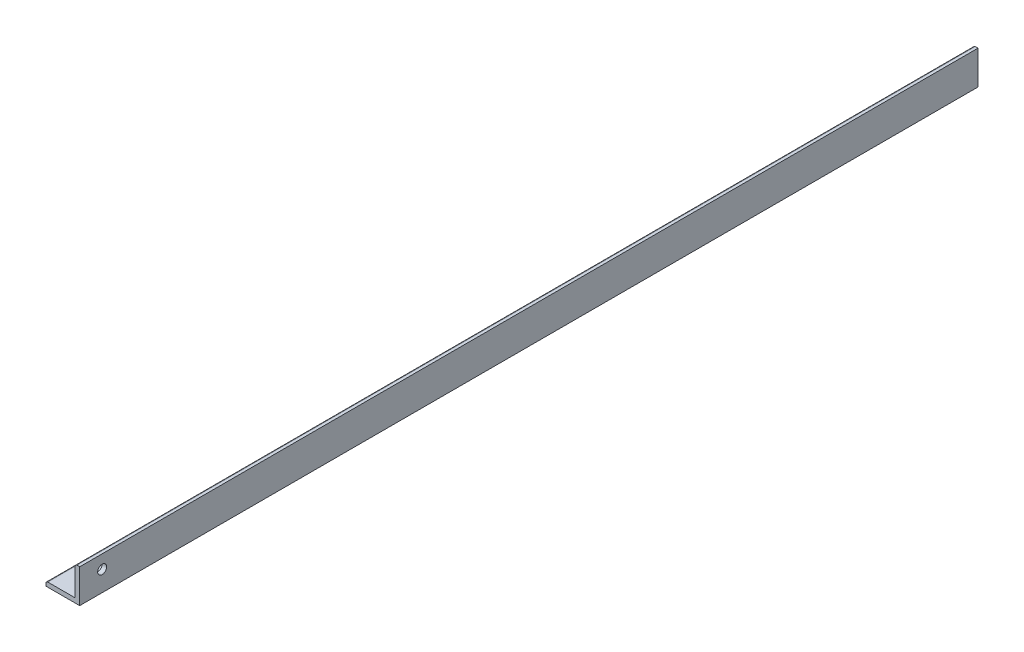
ISO-10303-21;
HEADER;
FILE_DESCRIPTION(('STEP AP214'),'2;1');
FILE_NAME('part.step','',(''),(''),'','','');
FILE_SCHEMA(('AUTOMOTIVE_DESIGN { 1 0 10303 214 1 1 1 1 }'));
ENDSEC;
DATA;
#1=APPLICATION_CONTEXT('core data for automotive mechanical design processes');
#2=APPLICATION_PROTOCOL_DEFINITION('international standard','automotive_design',2000,#1);
#3=PRODUCT_CONTEXT('',#1,'mechanical');
#4=PRODUCT('Part','Part','',(#3));
#5=PRODUCT_RELATED_PRODUCT_CATEGORY('part','',(#4));
#6=PRODUCT_DEFINITION_FORMATION('','',#4);
#7=PRODUCT_DEFINITION_CONTEXT('part definition',#1,'design');
#8=PRODUCT_DEFINITION('design','',#6,#7);
#9=PRODUCT_DEFINITION_SHAPE('','',#8);
#10=(LENGTH_UNIT() NAMED_UNIT(*) SI_UNIT(.MILLI.,.METRE.));
#11=(NAMED_UNIT(*) PLANE_ANGLE_UNIT() SI_UNIT($,.RADIAN.));
#12=(NAMED_UNIT(*) SI_UNIT($,.STERADIAN.) SOLID_ANGLE_UNIT());
#13=UNCERTAINTY_MEASURE_WITH_UNIT(LENGTH_MEASURE(1.E-05),#10,'distance_accuracy_value','');
#14=(GEOMETRIC_REPRESENTATION_CONTEXT(3) GLOBAL_UNCERTAINTY_ASSIGNED_CONTEXT((#13)) GLOBAL_UNIT_ASSIGNED_CONTEXT((#10,
#11,#12)) REPRESENTATION_CONTEXT('',''));
#15=CARTESIAN_POINT('',(0.,0.,0.));
#16=DIRECTION('',(0.,0.,1.));
#17=DIRECTION('',(1.,0.,0.));
#18=AXIS2_PLACEMENT_3D('',#15,#16,#17);
#19=CARTESIAN_POINT('',(0.,0.,400.));
#20=DIRECTION('',(0.,1.,0.));
#21=DIRECTION('',(-1.,0.,0.));
#22=AXIS2_PLACEMENT_3D('',#19,#20,#21);
#23=PLANE('',#22);
#24=CARTESIAN_POINT('',(-8.,0.,222.));
#25=DIRECTION('',(0.,1.,0.));
#26=DIRECTION('',(-1.,0.,0.));
#27=AXIS2_PLACEMENT_3D('',#24,#25,#26);
#28=CIRCLE('',#27,2.);
#29=CARTESIAN_POINT('',(-10.,0.,222.));
#30=VERTEX_POINT('',#29);
#31=EDGE_CURVE('E176',#30,#30,#28,.T.);
#32=ORIENTED_EDGE('',*,*,#31,.T.);
#33=EDGE_LOOP('',(#32));
#34=FACE_BOUND('',#33,.T.);
#35=DIRECTION('',(1.,0.,0.));
#36=VECTOR('',#35,1.);
#37=CARTESIAN_POINT('',(0.,0.,0.));
#38=LINE('',#37,#36);
#39=CARTESIAN_POINT('',(-15.,0.,0.));
#40=VERTEX_POINT('',#39);
#41=CARTESIAN_POINT('',(0.,0.,0.));
#42=VERTEX_POINT('',#41);
#43=EDGE_CURVE('E122',#40,#42,#38,.T.);
#44=ORIENTED_EDGE('',*,*,#43,.T.);
#45=DIRECTION('',(0.,0.,-1.));
#46=VECTOR('',#45,1.);
#47=CARTESIAN_POINT('',(0.,0.,400.));
#48=LINE('',#47,#46);
#49=CARTESIAN_POINT('',(0.,0.,400.));
#50=VERTEX_POINT('',#49);
#51=EDGE_CURVE('E104',#50,#42,#48,.T.);
#52=ORIENTED_EDGE('',*,*,#51,.F.);
#53=DIRECTION('',(1.,0.,0.));
#54=VECTOR('',#53,1.);
#55=CARTESIAN_POINT('',(0.,0.,400.));
#56=LINE('',#55,#54);
#57=CARTESIAN_POINT('',(-15.,0.,400.));
#58=VERTEX_POINT('',#57);
#59=EDGE_CURVE('E109',#58,#50,#56,.T.);
#60=ORIENTED_EDGE('',*,*,#59,.F.);
#61=DIRECTION('',(0.,0.,-1.));
#62=VECTOR('',#61,1.);
#63=CARTESIAN_POINT('',(-15.,0.,400.));
#64=LINE('',#63,#62);
#65=EDGE_CURVE('E164',#58,#40,#64,.T.);
#66=ORIENTED_EDGE('',*,*,#65,.T.);
#67=EDGE_LOOP('',(#44,#52,#60,#66));
#68=FACE_BOUND('',#67,.T.);
#69=ADVANCED_FACE('F35',(#34,#68),#23,.F.);
#70=CARTESIAN_POINT('',(0.,0.,400.));
#71=DIRECTION('',(-1.,0.,0.));
#72=DIRECTION('',(0.,0.,1.));
#73=AXIS2_PLACEMENT_3D('',#70,#71,#72);
#74=PLANE('',#73);
#75=CARTESIAN_POINT('',(0.,9.,390.));
#76=DIRECTION('',(-1.,0.,0.));
#77=DIRECTION('',(0.,0.,1.));
#78=AXIS2_PLACEMENT_3D('',#75,#76,#77);
#79=CIRCLE('',#78,2.);
#80=CARTESIAN_POINT('',(0.,9.,392.));
#81=VERTEX_POINT('',#80);
#82=EDGE_CURVE('E182',#81,#81,#79,.T.);
#83=ORIENTED_EDGE('',*,*,#82,.T.);
#84=EDGE_LOOP('',(#83));
#85=FACE_BOUND('',#84,.T.);
#86=DIRECTION('',(0.,1.,0.));
#87=VECTOR('',#86,1.);
#88=CARTESIAN_POINT('',(0.,0.,0.));
#89=LINE('',#88,#87);
#90=CARTESIAN_POINT('',(0.,15.,0.));
#91=VERTEX_POINT('',#90);
#92=EDGE_CURVE('E159',#42,#91,#89,.T.);
#93=ORIENTED_EDGE('',*,*,#92,.T.);
#94=DIRECTION('',(0.,0.,-1.));
#95=VECTOR('',#94,1.);
#96=CARTESIAN_POINT('',(0.,15.,400.));
#97=LINE('',#96,#95);
#98=CARTESIAN_POINT('',(0.,15.,400.));
#99=VERTEX_POINT('',#98);
#100=EDGE_CURVE('E107',#99,#91,#97,.T.);
#101=ORIENTED_EDGE('',*,*,#100,.F.);
#102=DIRECTION('',(0.,1.,0.));
#103=VECTOR('',#102,1.);
#104=CARTESIAN_POINT('',(0.,0.,400.));
#105=LINE('',#104,#103);
#106=EDGE_CURVE('E100',#50,#99,#105,.T.);
#107=ORIENTED_EDGE('',*,*,#106,.F.);
#108=ORIENTED_EDGE('',*,*,#51,.T.);
#109=EDGE_LOOP('',(#93,#101,#107,#108));
#110=FACE_BOUND('',#109,.T.);
#111=ADVANCED_FACE('F102',(#85,#110),#74,.F.);
#112=CARTESIAN_POINT('',(0.,15.,400.));
#113=DIRECTION('',(0.,-1.,0.));
#114=DIRECTION('',(0.,0.,-1.));
#115=AXIS2_PLACEMENT_3D('',#112,#113,#114);
#116=PLANE('',#115);
#117=DIRECTION('',(-1.,0.,0.));
#118=VECTOR('',#117,1.);
#119=CARTESIAN_POINT('',(0.,15.,0.));
#120=LINE('',#119,#118);
#121=CARTESIAN_POINT('',(-1.2,15.,0.));
#122=VERTEX_POINT('',#121);
#123=EDGE_CURVE('E156',#91,#122,#120,.T.);
#124=ORIENTED_EDGE('',*,*,#123,.T.);
#125=DIRECTION('',(0.,0.,-1.));
#126=VECTOR('',#125,1.);
#127=CARTESIAN_POINT('',(-1.2,15.,400.));
#128=LINE('',#127,#126);
#129=CARTESIAN_POINT('',(-1.2,15.,400.));
#130=VERTEX_POINT('',#129);
#131=EDGE_CURVE('E11',#122,#130,#128,.F.);
#132=ORIENTED_EDGE('',*,*,#131,.T.);
#133=DIRECTION('',(-1.,0.,0.));
#134=VECTOR('',#133,1.);
#135=CARTESIAN_POINT('',(0.,15.,400.));
#136=LINE('',#135,#134);
#137=EDGE_CURVE('E108',#99,#130,#136,.T.);
#138=ORIENTED_EDGE('',*,*,#137,.F.);
#139=ORIENTED_EDGE('',*,*,#100,.T.);
#140=EDGE_LOOP('',(#124,#132,#138,#139));
#141=FACE_BOUND('',#140,.T.);
#142=ADVANCED_FACE('F177',(#141),#116,.F.);
#143=CARTESIAN_POINT('',(-2.,15.,400.));
#144=DIRECTION('',(1.,0.,0.));
#145=DIRECTION('',(0.,1.,0.));
#146=AXIS2_PLACEMENT_3D('',#143,#144,#145);
#147=PLANE('',#146);
#148=CARTESIAN_POINT('',(-2.,9.,390.));
#149=DIRECTION('',(-1.,0.,0.));
#150=DIRECTION('',(0.,-1.,0.));
#151=AXIS2_PLACEMENT_3D('',#148,#149,#150);
#152=CIRCLE('',#151,2.);
#153=CARTESIAN_POINT('',(-2.,7.,390.));
#154=VERTEX_POINT('',#153);
#155=EDGE_CURVE('E187',#154,#154,#152,.T.);
#156=ORIENTED_EDGE('',*,*,#155,.F.);
#157=EDGE_LOOP('',(#156));
#158=FACE_BOUND('',#157,.T.);
#159=DIRECTION('',(0.,-1.,0.));
#160=VECTOR('',#159,1.);
#161=CARTESIAN_POINT('',(-2.,15.,400.));
#162=LINE('',#161,#160);
#163=CARTESIAN_POINT('',(-2.,14.2,400.));
#164=VERTEX_POINT('',#163);
#165=CARTESIAN_POINT('',(-2.,2.,400.));
#166=VERTEX_POINT('',#165);
#167=EDGE_CURVE('E147',#164,#166,#162,.T.);
#168=ORIENTED_EDGE('',*,*,#167,.F.);
#169=DIRECTION('',(0.,0.,-1.));
#170=VECTOR('',#169,1.);
#171=CARTESIAN_POINT('',(-2.,14.2,400.));
#172=LINE('',#171,#170);
#173=CARTESIAN_POINT('',(-2.,14.2,0.));
#174=VERTEX_POINT('',#173);
#175=EDGE_CURVE('E43',#164,#174,#172,.T.);
#176=ORIENTED_EDGE('',*,*,#175,.T.);
#177=DIRECTION('',(0.,-1.,0.));
#178=VECTOR('',#177,1.);
#179=CARTESIAN_POINT('',(-2.,15.,0.));
#180=LINE('',#179,#178);
#181=CARTESIAN_POINT('',(-2.,2.,0.));
#182=VERTEX_POINT('',#181);
#183=EDGE_CURVE('E145',#174,#182,#180,.T.);
#184=ORIENTED_EDGE('',*,*,#183,.T.);
#185=DIRECTION('',(0.,0.,-1.));
#186=VECTOR('',#185,1.);
#187=CARTESIAN_POINT('',(-2.,2.,400.));
#188=LINE('',#187,#186);
#189=EDGE_CURVE('E128',#166,#182,#188,.T.);
#190=ORIENTED_EDGE('',*,*,#189,.F.);
#191=EDGE_LOOP('',(#168,#176,#184,#190));
#192=FACE_BOUND('',#191,.T.);
#193=ADVANCED_FACE('F143',(#158,#192),#147,.F.);
#194=CARTESIAN_POINT('',(-15.,2.,400.));
#195=DIRECTION('',(0.,-1.,0.));
#196=DIRECTION('',(0.,0.,-1.));
#197=AXIS2_PLACEMENT_3D('',#194,#195,#196);
#198=PLANE('',#197);
#199=CARTESIAN_POINT('',(-8.,2.,222.));
#200=DIRECTION('',(0.,1.,0.));
#201=DIRECTION('',(-1.,0.,0.));
#202=AXIS2_PLACEMENT_3D('',#199,#200,#201);
#203=CIRCLE('',#202,2.);
#204=CARTESIAN_POINT('',(-10.,2.,222.));
#205=VERTEX_POINT('',#204);
#206=EDGE_CURVE('E179',#205,#205,#203,.T.);
#207=ORIENTED_EDGE('',*,*,#206,.F.);
#208=EDGE_LOOP('',(#207));
#209=FACE_BOUND('',#208,.T.);
#210=DIRECTION('',(-1.,0.,0.));
#211=VECTOR('',#210,1.);
#212=CARTESIAN_POINT('',(-15.,2.,0.));
#213=LINE('',#212,#211);
#214=CARTESIAN_POINT('',(-14.2,2.,0.));
#215=VERTEX_POINT('',#214);
#216=EDGE_CURVE('E155',#182,#215,#213,.T.);
#217=ORIENTED_EDGE('',*,*,#216,.T.);
#218=DIRECTION('',(0.,0.,-1.));
#219=VECTOR('',#218,1.);
#220=CARTESIAN_POINT('',(-14.2,2.,400.));
#221=LINE('',#220,#219);
#222=CARTESIAN_POINT('',(-14.2,2.,400.));
#223=VERTEX_POINT('',#222);
#224=EDGE_CURVE('E135',#215,#223,#221,.F.);
#225=ORIENTED_EDGE('',*,*,#224,.T.);
#226=DIRECTION('',(-1.,0.,0.));
#227=VECTOR('',#226,1.);
#228=CARTESIAN_POINT('',(-15.,2.,400.));
#229=LINE('',#228,#227);
#230=EDGE_CURVE('E169',#166,#223,#229,.T.);
#231=ORIENTED_EDGE('',*,*,#230,.F.);
#232=ORIENTED_EDGE('',*,*,#189,.T.);
#233=EDGE_LOOP('',(#217,#225,#231,#232));
#234=FACE_BOUND('',#233,.T.);
#235=ADVANCED_FACE('F167',(#209,#234),#198,.F.);
#236=CARTESIAN_POINT('',(-15.,0.,400.));
#237=DIRECTION('',(1.,0.,0.));
#238=DIRECTION('',(0.,0.,-1.));
#239=AXIS2_PLACEMENT_3D('',#236,#237,#238);
#240=PLANE('',#239);
#241=DIRECTION('',(0.,-1.,0.));
#242=VECTOR('',#241,1.);
#243=CARTESIAN_POINT('',(-15.,0.,400.));
#244=LINE('',#243,#242);
#245=CARTESIAN_POINT('',(-15.,1.2,400.));
#246=VERTEX_POINT('',#245);
#247=EDGE_CURVE('E115',#246,#58,#244,.T.);
#248=ORIENTED_EDGE('',*,*,#247,.F.);
#249=DIRECTION('',(0.,0.,-1.));
#250=VECTOR('',#249,1.);
#251=CARTESIAN_POINT('',(-15.,1.2,400.));
#252=LINE('',#251,#250);
#253=CARTESIAN_POINT('',(-15.,1.2,0.));
#254=VERTEX_POINT('',#253);
#255=EDGE_CURVE('E123',#246,#254,#252,.T.);
#256=ORIENTED_EDGE('',*,*,#255,.T.);
#257=DIRECTION('',(0.,-1.,0.));
#258=VECTOR('',#257,1.);
#259=CARTESIAN_POINT('',(-15.,0.,0.));
#260=LINE('',#259,#258);
#261=EDGE_CURVE('E119',#254,#40,#260,.T.);
#262=ORIENTED_EDGE('',*,*,#261,.T.);
#263=ORIENTED_EDGE('',*,*,#65,.F.);
#264=EDGE_LOOP('',(#248,#256,#262,#263));
#265=FACE_BOUND('',#264,.T.);
#266=ADVANCED_FACE('F200',(#265),#240,.F.);
#267=CARTESIAN_POINT('',(0.,0.,400.));
#268=DIRECTION('',(0.,0.,-1.));
#269=DIRECTION('',(-1.,0.,0.));
#270=AXIS2_PLACEMENT_3D('',#267,#268,#269);
#271=PLANE('',#270);
#272=ORIENTED_EDGE('',*,*,#230,.T.);
#273=CARTESIAN_POINT('',(-14.2,1.2,400.));
#274=DIRECTION('',(0.,0.,-1.));
#275=DIRECTION('',(-1.,0.,0.));
#276=AXIS2_PLACEMENT_3D('',#273,#274,#275);
#277=CIRCLE('',#276,0.8);
#278=EDGE_CURVE('E138',#223,#246,#277,.F.);
#279=ORIENTED_EDGE('',*,*,#278,.T.);
#280=ORIENTED_EDGE('',*,*,#247,.T.);
#281=ORIENTED_EDGE('',*,*,#59,.T.);
#282=ORIENTED_EDGE('',*,*,#106,.T.);
#283=ORIENTED_EDGE('',*,*,#137,.T.);
#284=CARTESIAN_POINT('',(-1.2,14.2,400.));
#285=DIRECTION('',(0.,0.,-1.));
#286=DIRECTION('',(-1.,0.,0.));
#287=AXIS2_PLACEMENT_3D('',#284,#285,#286);
#288=CIRCLE('',#287,0.8);
#289=EDGE_CURVE('E50',#130,#164,#288,.F.);
#290=ORIENTED_EDGE('',*,*,#289,.T.);
#291=ORIENTED_EDGE('',*,*,#167,.T.);
#292=EDGE_LOOP('',(#272,#279,#280,#281,#282,#283,#290,#291));
#293=FACE_BOUND('',#292,.T.);
#294=ADVANCED_FACE('F113',(#293),#271,.F.);
#295=CARTESIAN_POINT('',(0.,0.,0.));
#296=DIRECTION('',(0.,0.,-1.));
#297=DIRECTION('',(-1.,0.,0.));
#298=AXIS2_PLACEMENT_3D('',#295,#296,#297);
#299=PLANE('',#298);
#300=ORIENTED_EDGE('',*,*,#261,.F.);
#301=CARTESIAN_POINT('',(-14.2,1.2,0.));
#302=DIRECTION('',(0.,0.,-1.));
#303=DIRECTION('',(-1.,0.,0.));
#304=AXIS2_PLACEMENT_3D('',#301,#302,#303);
#305=CIRCLE('',#304,0.8);
#306=EDGE_CURVE('E133',#254,#215,#305,.T.);
#307=ORIENTED_EDGE('',*,*,#306,.T.);
#308=ORIENTED_EDGE('',*,*,#216,.F.);
#309=ORIENTED_EDGE('',*,*,#183,.F.);
#310=CARTESIAN_POINT('',(-1.2,14.2,0.));
#311=DIRECTION('',(0.,0.,-1.));
#312=DIRECTION('',(-1.,0.,0.));
#313=AXIS2_PLACEMENT_3D('',#310,#311,#312);
#314=CIRCLE('',#313,0.8);
#315=EDGE_CURVE('E126',#174,#122,#314,.T.);
#316=ORIENTED_EDGE('',*,*,#315,.T.);
#317=ORIENTED_EDGE('',*,*,#123,.F.);
#318=ORIENTED_EDGE('',*,*,#92,.F.);
#319=ORIENTED_EDGE('',*,*,#43,.F.);
#320=EDGE_LOOP('',(#300,#307,#308,#309,#316,#317,#318,#319));
#321=FACE_BOUND('',#320,.T.);
#322=ADVANCED_FACE('F152',(#321),#299,.T.);
#323=CARTESIAN_POINT('',(-14.2,1.2,400.));
#324=DIRECTION('',(0.,0.,-1.));
#325=DIRECTION('',(-1.,0.,0.));
#326=AXIS2_PLACEMENT_3D('',#323,#324,#325);
#327=CYLINDRICAL_SURFACE('',#326,0.8);
#328=ORIENTED_EDGE('',*,*,#278,.F.);
#329=ORIENTED_EDGE('',*,*,#224,.F.);
#330=ORIENTED_EDGE('',*,*,#306,.F.);
#331=ORIENTED_EDGE('',*,*,#255,.F.);
#332=EDGE_LOOP('',(#328,#329,#330,#331));
#333=FACE_BOUND('',#332,.T.);
#334=ADVANCED_FACE('F212',(#333),#327,.T.);
#335=CARTESIAN_POINT('',(-1.2,14.2,400.));
#336=DIRECTION('',(0.,0.,-1.));
#337=DIRECTION('',(-1.,0.,0.));
#338=AXIS2_PLACEMENT_3D('',#335,#336,#337);
#339=CYLINDRICAL_SURFACE('',#338,0.8);
#340=ORIENTED_EDGE('',*,*,#289,.F.);
#341=ORIENTED_EDGE('',*,*,#131,.F.);
#342=ORIENTED_EDGE('',*,*,#315,.F.);
#343=ORIENTED_EDGE('',*,*,#175,.F.);
#344=EDGE_LOOP('',(#340,#341,#342,#343));
#345=FACE_BOUND('',#344,.T.);
#346=ADVANCED_FACE('F37',(#345),#339,.T.);
#347=CARTESIAN_POINT('',(-8.,0.,222.));
#348=DIRECTION('',(0.,1.,0.));
#349=DIRECTION('',(-1.,0.,0.));
#350=AXIS2_PLACEMENT_3D('',#347,#348,#349);
#351=CYLINDRICAL_SURFACE('',#350,2.);
#352=ORIENTED_EDGE('',*,*,#31,.F.);
#353=EDGE_LOOP('',(#352));
#354=FACE_BOUND('',#353,.T.);
#355=ORIENTED_EDGE('',*,*,#206,.T.);
#356=EDGE_LOOP('',(#355));
#357=FACE_BOUND('',#356,.T.);
#358=ADVANCED_FACE('F219',(#354,#357),#351,.F.);
#359=CARTESIAN_POINT('',(398.,9.00000000000002,390.));
#360=DIRECTION('',(-1.,0.,0.));
#361=DIRECTION('',(0.,-1.,0.));
#362=AXIS2_PLACEMENT_3D('',#359,#360,#361);
#363=CYLINDRICAL_SURFACE('',#362,2.);
#364=ORIENTED_EDGE('',*,*,#155,.T.);
#365=EDGE_LOOP('',(#364));
#366=FACE_BOUND('',#365,.T.);
#367=ORIENTED_EDGE('',*,*,#82,.F.);
#368=EDGE_LOOP('',(#367));
#369=FACE_BOUND('',#368,.T.);
#370=ADVANCED_FACE('F191',(#366,#369),#363,.F.);
#371=CLOSED_SHELL('',(#69,#111,#142,#193,#235,#266,#294,#322,#334,#346,#358,#370));
#372=MANIFOLD_SOLID_BREP('B2',#371);
#373=ADVANCED_BREP_SHAPE_REPRESENTATION('',(#18,#372),#14);
#374=SHAPE_DEFINITION_REPRESENTATION(#9,#373);
ENDSEC;
END-ISO-10303-21;
